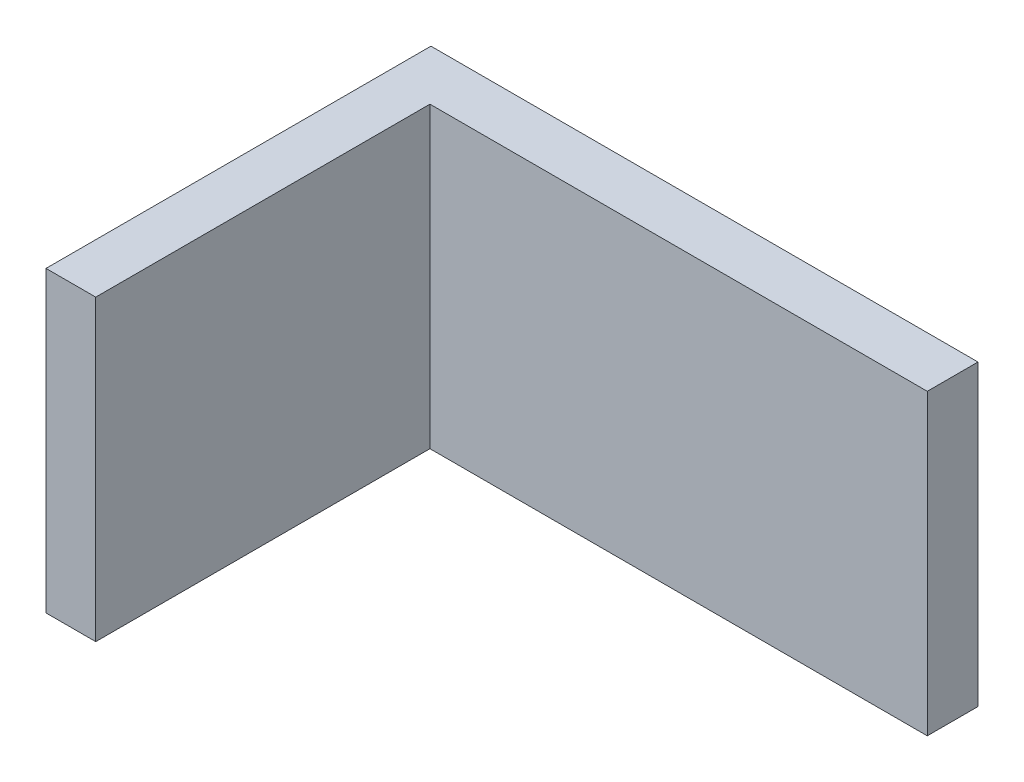
ISO-10303-21;
HEADER;
FILE_DESCRIPTION(('STEP AP214'),'2;1');
FILE_NAME('part.step','',(''),(''),'','','');
FILE_SCHEMA(('AUTOMOTIVE_DESIGN { 1 0 10303 214 1 1 1 1 }'));
ENDSEC;
DATA;
#1=APPLICATION_CONTEXT('core data for automotive mechanical design processes');
#2=APPLICATION_PROTOCOL_DEFINITION('international standard','automotive_design',2000,#1);
#3=PRODUCT_CONTEXT('',#1,'mechanical');
#4=PRODUCT('Part','Part','',(#3));
#5=PRODUCT_RELATED_PRODUCT_CATEGORY('part','',(#4));
#6=PRODUCT_DEFINITION_FORMATION('','',#4);
#7=PRODUCT_DEFINITION_CONTEXT('part definition',#1,'design');
#8=PRODUCT_DEFINITION('design','',#6,#7);
#9=PRODUCT_DEFINITION_SHAPE('','',#8);
#10=(LENGTH_UNIT() NAMED_UNIT(*) SI_UNIT(.MILLI.,.METRE.));
#11=(NAMED_UNIT(*) PLANE_ANGLE_UNIT() SI_UNIT($,.RADIAN.));
#12=(NAMED_UNIT(*) SI_UNIT($,.STERADIAN.) SOLID_ANGLE_UNIT());
#13=UNCERTAINTY_MEASURE_WITH_UNIT(LENGTH_MEASURE(1.E-05),#10,'distance_accuracy_value','');
#14=(GEOMETRIC_REPRESENTATION_CONTEXT(3) GLOBAL_UNCERTAINTY_ASSIGNED_CONTEXT((#13)) GLOBAL_UNIT_ASSIGNED_CONTEXT((#10,
#11,#12)) REPRESENTATION_CONTEXT('',''));
#15=CARTESIAN_POINT('',(0.,0.,0.));
#16=DIRECTION('',(0.,0.,1.));
#17=DIRECTION('',(1.,0.,0.));
#18=AXIS2_PLACEMENT_3D('',#15,#16,#17);
#19=CARTESIAN_POINT('',(-4.55,0.6,0.));
#20=DIRECTION('',(0.,-1.,0.));
#21=DIRECTION('',(0.,0.,1.));
#22=AXIS2_PLACEMENT_3D('',#19,#20,#21);
#23=PLANE('',#22);
#24=DIRECTION('',(-1.,0.,0.));
#25=VECTOR('',#24,1.);
#26=CARTESIAN_POINT('',(-4.,0.6,0.));
#27=LINE('',#26,#25);
#28=CARTESIAN_POINT('',(-4.,0.6,0.));
#29=VERTEX_POINT('',#28);
#30=CARTESIAN_POINT('',(-4.55,0.6,0.));
#31=VERTEX_POINT('',#30);
#32=EDGE_CURVE('E11',#29,#31,#27,.T.);
#33=ORIENTED_EDGE('',*,*,#32,.F.);
#34=DIRECTION('',(0.,0.,-1.));
#35=VECTOR('',#34,1.);
#36=CARTESIAN_POINT('',(-4.,0.6,0.051));
#37=LINE('',#36,#35);
#38=CARTESIAN_POINT('',(-4.,0.6,0.051));
#39=VERTEX_POINT('',#38);
#40=EDGE_CURVE('E24',#39,#29,#37,.T.);
#41=ORIENTED_EDGE('',*,*,#40,.F.);
#42=DIRECTION('',(1.,0.,0.));
#43=VECTOR('',#42,1.);
#44=CARTESIAN_POINT('',(-4.5,0.6,0.051));
#45=LINE('',#44,#43);
#46=CARTESIAN_POINT('',(-4.5,0.6,0.051));
#47=VERTEX_POINT('',#46);
#48=EDGE_CURVE('E87',#47,#39,#45,.T.);
#49=ORIENTED_EDGE('',*,*,#48,.F.);
#50=DIRECTION('',(0.,0.,-1.));
#51=VECTOR('',#50,1.);
#52=CARTESIAN_POINT('',(-4.5,0.6,0.387));
#53=LINE('',#52,#51);
#54=CARTESIAN_POINT('',(-4.5,0.6,0.387));
#55=VERTEX_POINT('',#54);
#56=EDGE_CURVE('E114',#55,#47,#53,.T.);
#57=ORIENTED_EDGE('',*,*,#56,.F.);
#58=DIRECTION('',(1.,0.,0.));
#59=VECTOR('',#58,1.);
#60=CARTESIAN_POINT('',(-4.55,0.6,0.387));
#61=LINE('',#60,#59);
#62=CARTESIAN_POINT('',(-4.55,0.6,0.387));
#63=VERTEX_POINT('',#62);
#64=EDGE_CURVE('E111',#63,#55,#61,.T.);
#65=ORIENTED_EDGE('',*,*,#64,.F.);
#66=DIRECTION('',(0.,0.,1.));
#67=VECTOR('',#66,1.);
#68=CARTESIAN_POINT('',(-4.55,0.6,0.));
#69=LINE('',#68,#67);
#70=EDGE_CURVE('E108',#31,#63,#69,.T.);
#71=ORIENTED_EDGE('',*,*,#70,.F.);
#72=EDGE_LOOP('',(#33,#41,#49,#57,#65,#71));
#73=FACE_BOUND('',#72,.T.);
#74=ADVANCED_FACE('F17',(#73),#23,.T.);
#75=CARTESIAN_POINT('',(-4.,0.9,0.));
#76=DIRECTION('',(0.,1.,0.));
#77=DIRECTION('',(0.,0.,1.));
#78=AXIS2_PLACEMENT_3D('',#75,#76,#77);
#79=PLANE('',#78);
#80=DIRECTION('',(1.,0.,0.));
#81=VECTOR('',#80,1.);
#82=CARTESIAN_POINT('',(-4.55,0.9,0.));
#83=LINE('',#82,#81);
#84=CARTESIAN_POINT('',(-4.55,0.9,0.));
#85=VERTEX_POINT('',#84);
#86=CARTESIAN_POINT('',(-4.,0.9,0.));
#87=VERTEX_POINT('',#86);
#88=EDGE_CURVE('E106',#85,#87,#83,.T.);
#89=ORIENTED_EDGE('',*,*,#88,.F.);
#90=DIRECTION('',(0.,0.,-1.));
#91=VECTOR('',#90,1.);
#92=CARTESIAN_POINT('',(-4.55,0.9,0.387));
#93=LINE('',#92,#91);
#94=CARTESIAN_POINT('',(-4.55,0.9,0.387));
#95=VERTEX_POINT('',#94);
#96=EDGE_CURVE('E103',#95,#85,#93,.T.);
#97=ORIENTED_EDGE('',*,*,#96,.F.);
#98=DIRECTION('',(-1.,0.,0.));
#99=VECTOR('',#98,1.);
#100=CARTESIAN_POINT('',(-4.5,0.9,0.387));
#101=LINE('',#100,#99);
#102=CARTESIAN_POINT('',(-4.5,0.9,0.387));
#103=VERTEX_POINT('',#102);
#104=EDGE_CURVE('E100',#103,#95,#101,.T.);
#105=ORIENTED_EDGE('',*,*,#104,.F.);
#106=DIRECTION('',(0.,0.,1.));
#107=VECTOR('',#106,1.);
#108=CARTESIAN_POINT('',(-4.5,0.9,0.051));
#109=LINE('',#108,#107);
#110=CARTESIAN_POINT('',(-4.5,0.9,0.051));
#111=VERTEX_POINT('',#110);
#112=EDGE_CURVE('E72',#111,#103,#109,.T.);
#113=ORIENTED_EDGE('',*,*,#112,.F.);
#114=DIRECTION('',(-1.,0.,0.));
#115=VECTOR('',#114,1.);
#116=CARTESIAN_POINT('',(-4.,0.9,0.051));
#117=LINE('',#116,#115);
#118=CARTESIAN_POINT('',(-4.,0.9,0.051));
#119=VERTEX_POINT('',#118);
#120=EDGE_CURVE('E66',#119,#111,#117,.T.);
#121=ORIENTED_EDGE('',*,*,#120,.F.);
#122=DIRECTION('',(0.,0.,1.));
#123=VECTOR('',#122,1.);
#124=CARTESIAN_POINT('',(-4.,0.9,0.));
#125=LINE('',#124,#123);
#126=EDGE_CURVE('E69',#87,#119,#125,.T.);
#127=ORIENTED_EDGE('',*,*,#126,.F.);
#128=EDGE_LOOP('',(#89,#97,#105,#113,#121,#127));
#129=FACE_BOUND('',#128,.T.);
#130=ADVANCED_FACE('F68',(#129),#79,.T.);
#131=CARTESIAN_POINT('',(-4.55,0.6,0.387));
#132=DIRECTION('',(0.,0.,1.));
#133=DIRECTION('',(0.,1.,0.));
#134=AXIS2_PLACEMENT_3D('',#131,#132,#133);
#135=PLANE('',#134);
#136=ORIENTED_EDGE('',*,*,#64,.T.);
#137=DIRECTION('',(0.,-1.,0.));
#138=VECTOR('',#137,1.);
#139=CARTESIAN_POINT('',(-4.5,0.9,0.387));
#140=LINE('',#139,#138);
#141=EDGE_CURVE('E83',#103,#55,#140,.T.);
#142=ORIENTED_EDGE('',*,*,#141,.F.);
#143=ORIENTED_EDGE('',*,*,#104,.T.);
#144=DIRECTION('',(0.,1.,0.));
#145=VECTOR('',#144,1.);
#146=CARTESIAN_POINT('',(-4.55,0.6,0.387));
#147=LINE('',#146,#145);
#148=EDGE_CURVE('E88',#63,#95,#147,.T.);
#149=ORIENTED_EDGE('',*,*,#148,.F.);
#150=EDGE_LOOP('',(#136,#142,#143,#149));
#151=FACE_BOUND('',#150,.T.);
#152=ADVANCED_FACE('F125',(#151),#135,.T.);
#153=CARTESIAN_POINT('',(-4.5,0.6,0.051));
#154=DIRECTION('',(0.,0.,1.));
#155=DIRECTION('',(0.,1.,0.));
#156=AXIS2_PLACEMENT_3D('',#153,#154,#155);
#157=PLANE('',#156);
#158=ORIENTED_EDGE('',*,*,#48,.T.);
#159=DIRECTION('',(0.,-1.,0.));
#160=VECTOR('',#159,1.);
#161=CARTESIAN_POINT('',(-4.,0.9,0.051));
#162=LINE('',#161,#160);
#163=EDGE_CURVE('E81',#119,#39,#162,.T.);
#164=ORIENTED_EDGE('',*,*,#163,.F.);
#165=ORIENTED_EDGE('',*,*,#120,.T.);
#166=DIRECTION('',(0.,1.,0.));
#167=VECTOR('',#166,1.);
#168=CARTESIAN_POINT('',(-4.5,0.6,0.051));
#169=LINE('',#168,#167);
#170=EDGE_CURVE('E89',#47,#111,#169,.T.);
#171=ORIENTED_EDGE('',*,*,#170,.F.);
#172=EDGE_LOOP('',(#158,#164,#165,#171));
#173=FACE_BOUND('',#172,.T.);
#174=ADVANCED_FACE('F86',(#173),#157,.T.);
#175=CARTESIAN_POINT('',(-4.55,0.9,0.));
#176=DIRECTION('',(-1.,0.,0.));
#177=DIRECTION('',(0.,0.,1.));
#178=AXIS2_PLACEMENT_3D('',#175,#176,#177);
#179=PLANE('',#178);
#180=DIRECTION('',(0.,1.,0.));
#181=VECTOR('',#180,1.);
#182=CARTESIAN_POINT('',(-4.55,0.6,0.));
#183=LINE('',#182,#181);
#184=EDGE_CURVE('E93',#31,#85,#183,.T.);
#185=ORIENTED_EDGE('',*,*,#184,.F.);
#186=ORIENTED_EDGE('',*,*,#70,.T.);
#187=ORIENTED_EDGE('',*,*,#148,.T.);
#188=ORIENTED_EDGE('',*,*,#96,.T.);
#189=EDGE_LOOP('',(#185,#186,#187,#188));
#190=FACE_BOUND('',#189,.T.);
#191=ADVANCED_FACE('F121',(#190),#179,.T.);
#192=CARTESIAN_POINT('',(-4.,0.6,0.));
#193=DIRECTION('',(1.,0.,0.));
#194=DIRECTION('',(0.,0.,1.));
#195=AXIS2_PLACEMENT_3D('',#192,#193,#194);
#196=PLANE('',#195);
#197=DIRECTION('',(0.,-1.,0.));
#198=VECTOR('',#197,1.);
#199=CARTESIAN_POINT('',(-4.,0.9,0.));
#200=LINE('',#199,#198);
#201=EDGE_CURVE('E82',#87,#29,#200,.T.);
#202=ORIENTED_EDGE('',*,*,#201,.F.);
#203=ORIENTED_EDGE('',*,*,#126,.T.);
#204=ORIENTED_EDGE('',*,*,#163,.T.);
#205=ORIENTED_EDGE('',*,*,#40,.T.);
#206=EDGE_LOOP('',(#202,#203,#204,#205));
#207=FACE_BOUND('',#206,.T.);
#208=ADVANCED_FACE('F80',(#207),#196,.T.);
#209=CARTESIAN_POINT('',(-4.5,0.6,0.051));
#210=DIRECTION('',(1.,0.,0.));
#211=DIRECTION('',(0.,0.,1.));
#212=AXIS2_PLACEMENT_3D('',#209,#210,#211);
#213=PLANE('',#212);
#214=ORIENTED_EDGE('',*,*,#170,.T.);
#215=ORIENTED_EDGE('',*,*,#112,.T.);
#216=ORIENTED_EDGE('',*,*,#141,.T.);
#217=ORIENTED_EDGE('',*,*,#56,.T.);
#218=EDGE_LOOP('',(#214,#215,#216,#217));
#219=FACE_BOUND('',#218,.T.);
#220=ADVANCED_FACE('F127',(#219),#213,.T.);
#221=CARTESIAN_POINT('',(-4.55,0.9,0.));
#222=DIRECTION('',(0.,0.,-1.));
#223=DIRECTION('',(0.,1.,0.));
#224=AXIS2_PLACEMENT_3D('',#221,#222,#223);
#225=PLANE('',#224);
#226=ORIENTED_EDGE('',*,*,#88,.T.);
#227=ORIENTED_EDGE('',*,*,#201,.T.);
#228=ORIENTED_EDGE('',*,*,#32,.T.);
#229=ORIENTED_EDGE('',*,*,#184,.T.);
#230=EDGE_LOOP('',(#226,#227,#228,#229));
#231=FACE_BOUND('',#230,.T.);
#232=ADVANCED_FACE('F117',(#231),#225,.T.);
#233=CLOSED_SHELL('',(#74,#130,#152,#174,#191,#208,#220,#232));
#234=MANIFOLD_SOLID_BREP('B1',#233);
#235=ADVANCED_BREP_SHAPE_REPRESENTATION('',(#18,#234),#14);
#236=SHAPE_DEFINITION_REPRESENTATION(#9,#235);
ENDSEC;
END-ISO-10303-21;
